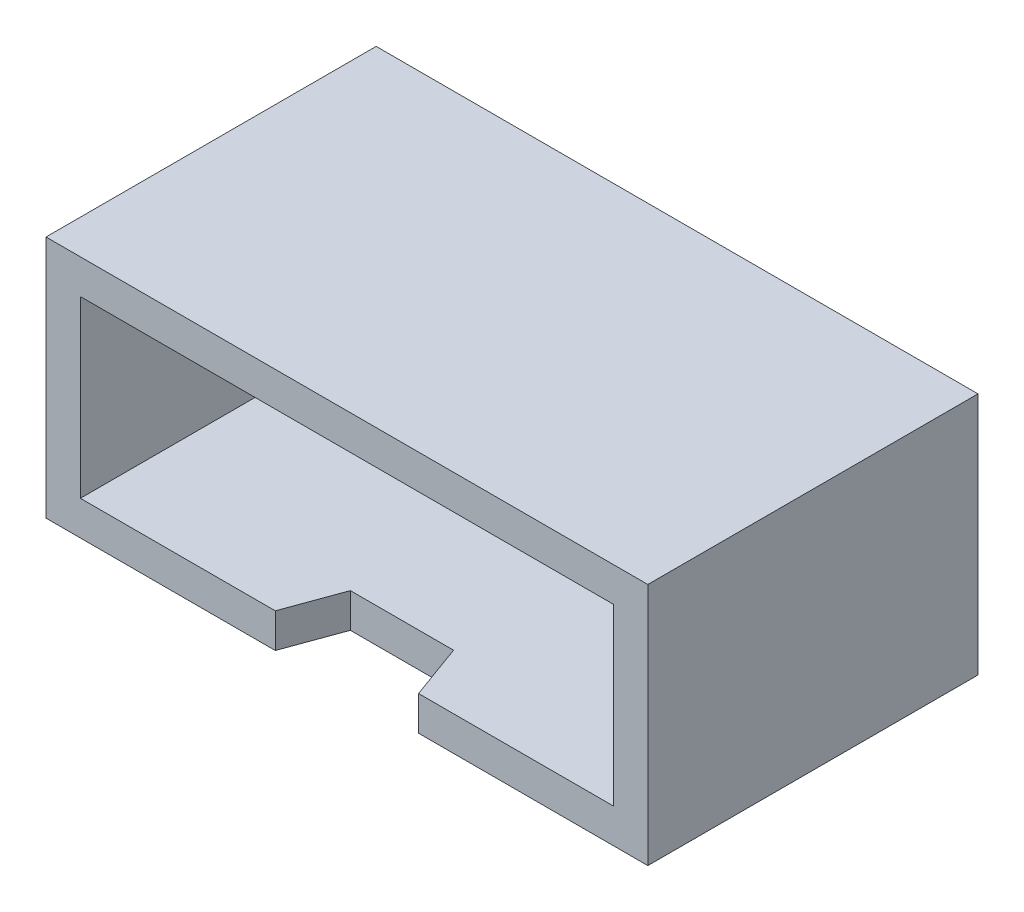
ISO-10303-21;
HEADER;
FILE_DESCRIPTION(('STEP AP214'),'2;1');
FILE_NAME('part.step','',(''),(''),'','','');
FILE_SCHEMA(('AUTOMOTIVE_DESIGN { 1 0 10303 214 1 1 1 1 }'));
ENDSEC;
DATA;
#1=APPLICATION_CONTEXT('core data for automotive mechanical design processes');
#2=APPLICATION_PROTOCOL_DEFINITION('international standard','automotive_design',2000,#1);
#3=PRODUCT_CONTEXT('',#1,'mechanical');
#4=PRODUCT('Part','Part','',(#3));
#5=PRODUCT_RELATED_PRODUCT_CATEGORY('part','',(#4));
#6=PRODUCT_DEFINITION_FORMATION('','',#4);
#7=PRODUCT_DEFINITION_CONTEXT('part definition',#1,'design');
#8=PRODUCT_DEFINITION('design','',#6,#7);
#9=PRODUCT_DEFINITION_SHAPE('','',#8);
#10=(LENGTH_UNIT() NAMED_UNIT(*) SI_UNIT(.MILLI.,.METRE.));
#11=(NAMED_UNIT(*) PLANE_ANGLE_UNIT() SI_UNIT($,.RADIAN.));
#12=(NAMED_UNIT(*) SI_UNIT($,.STERADIAN.) SOLID_ANGLE_UNIT());
#13=UNCERTAINTY_MEASURE_WITH_UNIT(LENGTH_MEASURE(1.E-05),#10,'distance_accuracy_value','');
#14=(GEOMETRIC_REPRESENTATION_CONTEXT(3) GLOBAL_UNCERTAINTY_ASSIGNED_CONTEXT((#13)) GLOBAL_UNIT_ASSIGNED_CONTEXT((#10,
#11,#12)) REPRESENTATION_CONTEXT('',''));
#15=CARTESIAN_POINT('',(0.,0.,0.));
#16=DIRECTION('',(0.,0.,1.));
#17=DIRECTION('',(1.,0.,0.));
#18=AXIS2_PLACEMENT_3D('',#15,#16,#17);
#19=CARTESIAN_POINT('',(7.98,-3.54,8.));
#20=DIRECTION('',(0.,0.,-1.));
#21=DIRECTION('',(-1.,0.,0.));
#22=AXIS2_PLACEMENT_3D('',#19,#20,#21);
#23=PLANE('',#22);
#24=DIRECTION('',(0.,1.,0.));
#25=VECTOR('',#24,1.);
#26=CARTESIAN_POINT('',(4.98,-3.54,8.));
#27=LINE('',#26,#25);
#28=CARTESIAN_POINT('',(4.98,-2.53999998509884,8.));
#29=VERTEX_POINT('',#28);
#30=CARTESIAN_POINT('',(4.98,-3.54,8.));
#31=VERTEX_POINT('',#30);
#32=EDGE_CURVE('E102',#29,#31,#27,.F.);
#33=ORIENTED_EDGE('',*,*,#32,.T.);
#34=DIRECTION('',(1.,0.,0.));
#35=VECTOR('',#34,1.);
#36=CARTESIAN_POINT('',(-2.27,-3.54,8.));
#37=LINE('',#36,#35);
#38=CARTESIAN_POINT('',(7.98,-3.54,8.));
#39=VERTEX_POINT('',#38);
#40=EDGE_CURVE('E112',#39,#31,#37,.F.);
#41=ORIENTED_EDGE('',*,*,#40,.F.);
#42=DIRECTION('',(0.,1.,0.));
#43=VECTOR('',#42,1.);
#44=CARTESIAN_POINT('',(7.98,-3.54,8.));
#45=LINE('',#44,#43);
#46=CARTESIAN_POINT('',(7.98,-2.53999998509884,8.));
#47=VERTEX_POINT('',#46);
#48=EDGE_CURVE('E20',#39,#47,#45,.T.);
#49=ORIENTED_EDGE('',*,*,#48,.T.);
#50=DIRECTION('',(1.,0.,0.));
#51=VECTOR('',#50,1.);
#52=CARTESIAN_POINT('',(14.2299999850988,-2.53999998509884,8.));
#53=LINE('',#52,#51);
#54=EDGE_CURVE('E109',#29,#47,#53,.T.);
#55=ORIENTED_EDGE('',*,*,#54,.F.);
#56=EDGE_LOOP('',(#33,#41,#49,#55));
#57=FACE_BOUND('',#56,.T.);
#58=ADVANCED_FACE('F17',(#57),#23,.F.);
#59=CARTESIAN_POINT('',(8.56235237482626,-3.54,9.6));
#60=DIRECTION('',(0.939692620785844,0.,-0.342020143325846));
#61=DIRECTION('',(-0.342020143325846,0.,-0.939692620785844));
#62=AXIS2_PLACEMENT_3D('',#59,#60,#61);
#63=PLANE('',#62);
#64=ORIENTED_EDGE('',*,*,#48,.F.);
#65=DIRECTION('',(-0.342020143325842,0.,-0.939692620785845));
#66=VECTOR('',#65,1.);
#67=CARTESIAN_POINT('',(8.56235237482626,-3.54,9.6));
#68=LINE('',#67,#66);
#69=CARTESIAN_POINT('',(8.56235237482626,-3.54,9.6));
#70=VERTEX_POINT('',#69);
#71=EDGE_CURVE('E129',#70,#39,#68,.T.);
#72=ORIENTED_EDGE('',*,*,#71,.F.);
#73=DIRECTION('',(0.,1.,0.));
#74=VECTOR('',#73,1.);
#75=CARTESIAN_POINT('',(8.56235237482626,0.,9.6));
#76=LINE('',#75,#74);
#77=CARTESIAN_POINT('',(8.56235237482626,-2.53999998509884,9.6));
#78=VERTEX_POINT('',#77);
#79=EDGE_CURVE('E119',#78,#70,#76,.F.);
#80=ORIENTED_EDGE('',*,*,#79,.F.);
#81=DIRECTION('',(0.342020143325843,0.,0.939692620785845));
#82=VECTOR('',#81,1.);
#83=CARTESIAN_POINT('',(7.98,-2.53999998509884,8.));
#84=LINE('',#83,#82);
#85=EDGE_CURVE('E116',#47,#78,#84,.T.);
#86=ORIENTED_EDGE('',*,*,#85,.F.);
#87=EDGE_LOOP('',(#64,#72,#80,#86));
#88=FACE_BOUND('',#87,.T.);
#89=ADVANCED_FACE('F117',(#88),#63,.F.);
#90=CARTESIAN_POINT('',(4.98,-3.54,8.));
#91=DIRECTION('',(-0.939692620785775,0.,-0.342020143326035));
#92=DIRECTION('',(-0.342020143326035,0.,0.939692620785775));
#93=AXIS2_PLACEMENT_3D('',#90,#91,#92);
#94=PLANE('',#93);
#95=DIRECTION('',(0.,1.,0.));
#96=VECTOR('',#95,1.);
#97=CARTESIAN_POINT('',(4.39764762517337,0.,9.6));
#98=LINE('',#97,#96);
#99=CARTESIAN_POINT('',(4.39764762517337,-3.54,9.6));
#100=VERTEX_POINT('',#99);
#101=CARTESIAN_POINT('',(4.39764762517337,-2.53999998509884,9.6));
#102=VERTEX_POINT('',#101);
#103=EDGE_CURVE('E146',#100,#102,#98,.T.);
#104=ORIENTED_EDGE('',*,*,#103,.F.);
#105=DIRECTION('',(-0.342020143326035,0.,0.939692620785775));
#106=VECTOR('',#105,1.);
#107=CARTESIAN_POINT('',(4.98,-3.54,8.));
#108=LINE('',#107,#106);
#109=EDGE_CURVE('E143',#31,#100,#108,.T.);
#110=ORIENTED_EDGE('',*,*,#109,.F.);
#111=ORIENTED_EDGE('',*,*,#32,.F.);
#112=DIRECTION('',(0.342020143326036,0.,-0.939692620785775));
#113=VECTOR('',#112,1.);
#114=CARTESIAN_POINT('',(4.39764762517337,-2.53999998509884,9.6));
#115=LINE('',#114,#113);
#116=EDGE_CURVE('E128',#102,#29,#115,.T.);
#117=ORIENTED_EDGE('',*,*,#116,.F.);
#118=EDGE_LOOP('',(#104,#110,#111,#117));
#119=FACE_BOUND('',#118,.T.);
#120=ADVANCED_FACE('F144',(#119),#94,.F.);
#121=CARTESIAN_POINT('',(-1.26999998509884,-2.53999998509884,0.));
#122=DIRECTION('',(1.,0.,0.));
#123=DIRECTION('',(0.,1.,0.));
#124=AXIS2_PLACEMENT_3D('',#121,#122,#123);
#125=PLANE('',#124);
#126=DIRECTION('',(0.,1.,0.));
#127=VECTOR('',#126,1.);
#128=CARTESIAN_POINT('',(-1.26999998509884,0.,9.6));
#129=LINE('',#128,#127);
#130=CARTESIAN_POINT('',(-1.26999998509884,-2.53999998509884,9.6));
#131=VERTEX_POINT('',#130);
#132=CARTESIAN_POINT('',(-1.26999998509884,2.53999998509884,9.6));
#133=VERTEX_POINT('',#132);
#134=EDGE_CURVE('E184',#131,#133,#129,.T.);
#135=ORIENTED_EDGE('',*,*,#134,.F.);
#136=DIRECTION('',(0.,0.,1.));
#137=VECTOR('',#136,1.);
#138=CARTESIAN_POINT('',(-1.26999998509884,-2.53999998509884,0.));
#139=LINE('',#138,#137);
#140=CARTESIAN_POINT('',(-1.26999998509884,-2.53999998509884,0.));
#141=VERTEX_POINT('',#140);
#142=EDGE_CURVE('E132',#141,#131,#139,.T.);
#143=ORIENTED_EDGE('',*,*,#142,.F.);
#144=DIRECTION('',(0.,1.,0.));
#145=VECTOR('',#144,1.);
#146=CARTESIAN_POINT('',(-1.26999998509884,0.,0.));
#147=LINE('',#146,#145);
#148=CARTESIAN_POINT('',(-1.26999998509884,2.53999998509884,0.));
#149=VERTEX_POINT('',#148);
#150=EDGE_CURVE('E162',#141,#149,#147,.T.);
#151=ORIENTED_EDGE('',*,*,#150,.T.);
#152=DIRECTION('',(0.,0.,-1.));
#153=VECTOR('',#152,1.);
#154=CARTESIAN_POINT('',(-1.26999998509884,2.53999998509884,0.));
#155=LINE('',#154,#153);
#156=EDGE_CURVE('E140',#133,#149,#155,.T.);
#157=ORIENTED_EDGE('',*,*,#156,.F.);
#158=EDGE_LOOP('',(#135,#143,#151,#157));
#159=FACE_BOUND('',#158,.T.);
#160=ADVANCED_FACE('F247',(#159),#125,.T.);
#161=CARTESIAN_POINT('',(-1.26999998509884,2.53999998509884,0.));
#162=DIRECTION('',(0.,-1.,0.));
#163=DIRECTION('',(0.,0.,-1.));
#164=AXIS2_PLACEMENT_3D('',#161,#162,#163);
#165=PLANE('',#164);
#166=DIRECTION('',(1.,0.,0.));
#167=VECTOR('',#166,1.);
#168=CARTESIAN_POINT('',(6.48,2.53999998509884,9.6));
#169=LINE('',#168,#167);
#170=CARTESIAN_POINT('',(14.2299999850988,2.53999998509884,9.6));
#171=VERTEX_POINT('',#170);
#172=EDGE_CURVE('E187',#133,#171,#169,.T.);
#173=ORIENTED_EDGE('',*,*,#172,.F.);
#174=ORIENTED_EDGE('',*,*,#156,.T.);
#175=DIRECTION('',(1.,0.,0.));
#176=VECTOR('',#175,1.);
#177=CARTESIAN_POINT('',(6.48,2.53999998509884,0.));
#178=LINE('',#177,#176);
#179=CARTESIAN_POINT('',(14.2299999850988,2.53999998509884,0.));
#180=VERTEX_POINT('',#179);
#181=EDGE_CURVE('E164',#149,#180,#178,.T.);
#182=ORIENTED_EDGE('',*,*,#181,.T.);
#183=DIRECTION('',(0.,0.,1.));
#184=VECTOR('',#183,1.);
#185=CARTESIAN_POINT('',(14.2299999850988,2.53999998509884,0.));
#186=LINE('',#185,#184);
#187=EDGE_CURVE('E124',#171,#180,#186,.F.);
#188=ORIENTED_EDGE('',*,*,#187,.F.);
#189=EDGE_LOOP('',(#173,#174,#182,#188));
#190=FACE_BOUND('',#189,.T.);
#191=ADVANCED_FACE('F243',(#190),#165,.T.);
#192=CARTESIAN_POINT('',(14.2299999850988,2.53999998509884,0.));
#193=DIRECTION('',(-1.,0.,0.));
#194=DIRECTION('',(0.,0.,1.));
#195=AXIS2_PLACEMENT_3D('',#192,#193,#194);
#196=PLANE('',#195);
#197=DIRECTION('',(0.,1.,0.));
#198=VECTOR('',#197,1.);
#199=CARTESIAN_POINT('',(14.2299999850988,0.,9.6));
#200=LINE('',#199,#198);
#201=CARTESIAN_POINT('',(14.2299999850988,-2.53999998509884,9.6));
#202=VERTEX_POINT('',#201);
#203=EDGE_CURVE('E190',#171,#202,#200,.F.);
#204=ORIENTED_EDGE('',*,*,#203,.F.);
#205=ORIENTED_EDGE('',*,*,#187,.T.);
#206=DIRECTION('',(0.,1.,0.));
#207=VECTOR('',#206,1.);
#208=CARTESIAN_POINT('',(14.2299999850988,0.,0.));
#209=LINE('',#208,#207);
#210=CARTESIAN_POINT('',(14.2299999850988,-2.53999998509884,0.));
#211=VERTEX_POINT('',#210);
#212=EDGE_CURVE('E157',#180,#211,#209,.F.);
#213=ORIENTED_EDGE('',*,*,#212,.T.);
#214=DIRECTION('',(0.,0.,1.));
#215=VECTOR('',#214,1.);
#216=CARTESIAN_POINT('',(14.2299999850988,-2.53999998509884,0.));
#217=LINE('',#216,#215);
#218=EDGE_CURVE('E123',#202,#211,#217,.F.);
#219=ORIENTED_EDGE('',*,*,#218,.F.);
#220=EDGE_LOOP('',(#204,#205,#213,#219));
#221=FACE_BOUND('',#220,.T.);
#222=ADVANCED_FACE('F240',(#221),#196,.T.);
#223=CARTESIAN_POINT('',(14.2299999850988,-2.53999998509884,0.));
#224=DIRECTION('',(0.,1.,0.));
#225=DIRECTION('',(0.,0.,1.));
#226=AXIS2_PLACEMENT_3D('',#223,#224,#225);
#227=PLANE('',#226);
#228=ORIENTED_EDGE('',*,*,#116,.T.);
#229=ORIENTED_EDGE('',*,*,#54,.T.);
#230=ORIENTED_EDGE('',*,*,#85,.T.);
#231=DIRECTION('',(1.,0.,0.));
#232=VECTOR('',#231,1.);
#233=CARTESIAN_POINT('',(6.48,-2.53999998509884,9.6));
#234=LINE('',#233,#232);
#235=EDGE_CURVE('E193',#202,#78,#234,.F.);
#236=ORIENTED_EDGE('',*,*,#235,.F.);
#237=ORIENTED_EDGE('',*,*,#218,.T.);
#238=DIRECTION('',(1.,0.,0.));
#239=VECTOR('',#238,1.);
#240=CARTESIAN_POINT('',(6.48,-2.53999998509884,0.));
#241=LINE('',#240,#239);
#242=EDGE_CURVE('E159',#211,#141,#241,.F.);
#243=ORIENTED_EDGE('',*,*,#242,.T.);
#244=ORIENTED_EDGE('',*,*,#142,.T.);
#245=DIRECTION('',(1.,0.,0.));
#246=VECTOR('',#245,1.);
#247=CARTESIAN_POINT('',(6.48,-2.53999998509884,9.6));
#248=LINE('',#247,#246);
#249=EDGE_CURVE('E181',#102,#131,#248,.F.);
#250=ORIENTED_EDGE('',*,*,#249,.F.);
#251=EDGE_LOOP('',(#228,#229,#230,#236,#237,#243,#244,#250));
#252=FACE_BOUND('',#251,.T.);
#253=ADVANCED_FACE('F126',(#252),#227,.T.);
#254=CARTESIAN_POINT('',(-2.27,-3.54,0.));
#255=DIRECTION('',(0.,-1.,0.));
#256=DIRECTION('',(0.,0.,-1.));
#257=AXIS2_PLACEMENT_3D('',#254,#255,#256);
#258=PLANE('',#257);
#259=DIRECTION('',(0.,0.,-1.));
#260=VECTOR('',#259,1.);
#261=CARTESIAN_POINT('',(15.23,-3.54,0.));
#262=LINE('',#261,#260);
#263=CARTESIAN_POINT('',(15.23,-3.54,9.6));
#264=VERTEX_POINT('',#263);
#265=CARTESIAN_POINT('',(15.23,-3.54,0.));
#266=VERTEX_POINT('',#265);
#267=EDGE_CURVE('E199',#264,#266,#262,.T.);
#268=ORIENTED_EDGE('',*,*,#267,.F.);
#269=DIRECTION('',(1.,0.,0.));
#270=VECTOR('',#269,1.);
#271=CARTESIAN_POINT('',(6.48,-3.54,9.6));
#272=LINE('',#271,#270);
#273=EDGE_CURVE('E173',#70,#264,#272,.T.);
#274=ORIENTED_EDGE('',*,*,#273,.F.);
#275=ORIENTED_EDGE('',*,*,#71,.T.);
#276=ORIENTED_EDGE('',*,*,#40,.T.);
#277=ORIENTED_EDGE('',*,*,#109,.T.);
#278=DIRECTION('',(1.,0.,0.));
#279=VECTOR('',#278,1.);
#280=CARTESIAN_POINT('',(6.48,-3.54,9.6));
#281=LINE('',#280,#279);
#282=CARTESIAN_POINT('',(-2.27,-3.54,9.6));
#283=VERTEX_POINT('',#282);
#284=EDGE_CURVE('E178',#283,#100,#281,.T.);
#285=ORIENTED_EDGE('',*,*,#284,.F.);
#286=DIRECTION('',(0.,0.,1.));
#287=VECTOR('',#286,1.);
#288=CARTESIAN_POINT('',(-2.27,-3.54,0.));
#289=LINE('',#288,#287);
#290=CARTESIAN_POINT('',(-2.27,-3.54,0.));
#291=VERTEX_POINT('',#290);
#292=EDGE_CURVE('E170',#291,#283,#289,.T.);
#293=ORIENTED_EDGE('',*,*,#292,.F.);
#294=DIRECTION('',(1.,0.,0.));
#295=VECTOR('',#294,1.);
#296=CARTESIAN_POINT('',(6.48,-3.54,0.));
#297=LINE('',#296,#295);
#298=EDGE_CURVE('E150',#291,#266,#297,.T.);
#299=ORIENTED_EDGE('',*,*,#298,.T.);
#300=EDGE_LOOP('',(#268,#274,#275,#276,#277,#285,#293,#299));
#301=FACE_BOUND('',#300,.T.);
#302=ADVANCED_FACE('F153',(#301),#258,.T.);
#303=CARTESIAN_POINT('',(6.48,0.,0.));
#304=DIRECTION('',(0.,0.,1.));
#305=DIRECTION('',(1.,0.,0.));
#306=AXIS2_PLACEMENT_3D('',#303,#304,#305);
#307=PLANE('',#306);
#308=ORIENTED_EDGE('',*,*,#150,.F.);
#309=ORIENTED_EDGE('',*,*,#242,.F.);
#310=ORIENTED_EDGE('',*,*,#212,.F.);
#311=ORIENTED_EDGE('',*,*,#181,.F.);
#312=EDGE_LOOP('',(#308,#309,#310,#311));
#313=FACE_BOUND('',#312,.T.);
#314=DIRECTION('',(0.,1.,0.));
#315=VECTOR('',#314,1.);
#316=CARTESIAN_POINT('',(-2.27,3.54,0.));
#317=LINE('',#316,#315);
#318=CARTESIAN_POINT('',(-2.27,3.54,0.));
#319=VERTEX_POINT('',#318);
#320=EDGE_CURVE('E167',#319,#291,#317,.F.);
#321=ORIENTED_EDGE('',*,*,#320,.F.);
#322=DIRECTION('',(1.,0.,0.));
#323=VECTOR('',#322,1.);
#324=CARTESIAN_POINT('',(15.23,3.54,0.));
#325=LINE('',#324,#323);
#326=CARTESIAN_POINT('',(15.23,3.54,0.));
#327=VERTEX_POINT('',#326);
#328=EDGE_CURVE('E202',#327,#319,#325,.F.);
#329=ORIENTED_EDGE('',*,*,#328,.F.);
#330=DIRECTION('',(0.,1.,0.));
#331=VECTOR('',#330,1.);
#332=CARTESIAN_POINT('',(15.23,-3.54,0.));
#333=LINE('',#332,#331);
#334=EDGE_CURVE('E195',#266,#327,#333,.T.);
#335=ORIENTED_EDGE('',*,*,#334,.F.);
#336=ORIENTED_EDGE('',*,*,#298,.F.);
#337=EDGE_LOOP('',(#321,#329,#335,#336));
#338=FACE_BOUND('',#337,.T.);
#339=ADVANCED_FACE('F218',(#313,#338),#307,.F.);
#340=CARTESIAN_POINT('',(-2.27,3.54,0.));
#341=DIRECTION('',(-1.,0.,0.));
#342=DIRECTION('',(0.,0.,1.));
#343=AXIS2_PLACEMENT_3D('',#340,#341,#342);
#344=PLANE('',#343);
#345=DIRECTION('',(0.,1.,0.));
#346=VECTOR('',#345,1.);
#347=CARTESIAN_POINT('',(-2.27,0.,9.6));
#348=LINE('',#347,#346);
#349=CARTESIAN_POINT('',(-2.27,3.54,9.6));
#350=VERTEX_POINT('',#349);
#351=EDGE_CURVE('E175',#350,#283,#348,.F.);
#352=ORIENTED_EDGE('',*,*,#351,.F.);
#353=DIRECTION('',(0.,0.,1.));
#354=VECTOR('',#353,1.);
#355=CARTESIAN_POINT('',(-2.27,3.54,0.));
#356=LINE('',#355,#354);
#357=EDGE_CURVE('E205',#319,#350,#356,.T.);
#358=ORIENTED_EDGE('',*,*,#357,.F.);
#359=ORIENTED_EDGE('',*,*,#320,.T.);
#360=ORIENTED_EDGE('',*,*,#292,.T.);
#361=EDGE_LOOP('',(#352,#358,#359,#360));
#362=FACE_BOUND('',#361,.T.);
#363=ADVANCED_FACE('F214',(#362),#344,.T.);
#364=CARTESIAN_POINT('',(6.48,0.,9.6));
#365=DIRECTION('',(0.,0.,1.));
#366=DIRECTION('',(1.,0.,0.));
#367=AXIS2_PLACEMENT_3D('',#364,#365,#366);
#368=PLANE('',#367);
#369=ORIENTED_EDGE('',*,*,#203,.T.);
#370=ORIENTED_EDGE('',*,*,#235,.T.);
#371=ORIENTED_EDGE('',*,*,#79,.T.);
#372=ORIENTED_EDGE('',*,*,#273,.T.);
#373=DIRECTION('',(0.,1.,0.));
#374=VECTOR('',#373,1.);
#375=CARTESIAN_POINT('',(15.23,-3.54,9.6));
#376=LINE('',#375,#374);
#377=CARTESIAN_POINT('',(15.23,3.54,9.6));
#378=VERTEX_POINT('',#377);
#379=EDGE_CURVE('E35',#378,#264,#376,.F.);
#380=ORIENTED_EDGE('',*,*,#379,.F.);
#381=DIRECTION('',(1.,0.,0.));
#382=VECTOR('',#381,1.);
#383=CARTESIAN_POINT('',(15.23,3.54,9.6));
#384=LINE('',#383,#382);
#385=EDGE_CURVE('E26',#350,#378,#384,.T.);
#386=ORIENTED_EDGE('',*,*,#385,.F.);
#387=ORIENTED_EDGE('',*,*,#351,.T.);
#388=ORIENTED_EDGE('',*,*,#284,.T.);
#389=ORIENTED_EDGE('',*,*,#103,.T.);
#390=ORIENTED_EDGE('',*,*,#249,.T.);
#391=ORIENTED_EDGE('',*,*,#134,.T.);
#392=ORIENTED_EDGE('',*,*,#172,.T.);
#393=EDGE_LOOP('',(#369,#370,#371,#372,#380,#386,#387,#388,#389,#390,#391,#392));
#394=FACE_BOUND('',#393,.T.);
#395=ADVANCED_FACE('F212',(#394),#368,.T.);
#396=CARTESIAN_POINT('',(15.23,-3.54,0.));
#397=DIRECTION('',(1.,0.,0.));
#398=DIRECTION('',(0.,0.,-1.));
#399=AXIS2_PLACEMENT_3D('',#396,#397,#398);
#400=PLANE('',#399);
#401=ORIENTED_EDGE('',*,*,#379,.T.);
#402=ORIENTED_EDGE('',*,*,#267,.T.);
#403=ORIENTED_EDGE('',*,*,#334,.T.);
#404=DIRECTION('',(0.,0.,1.));
#405=VECTOR('',#404,1.);
#406=CARTESIAN_POINT('',(15.23,3.54,0.));
#407=LINE('',#406,#405);
#408=EDGE_CURVE('E11',#378,#327,#407,.F.);
#409=ORIENTED_EDGE('',*,*,#408,.F.);
#410=EDGE_LOOP('',(#401,#402,#403,#409));
#411=FACE_BOUND('',#410,.T.);
#412=ADVANCED_FACE('F220',(#411),#400,.T.);
#413=CARTESIAN_POINT('',(15.23,3.54,0.));
#414=DIRECTION('',(0.,1.,0.));
#415=DIRECTION('',(0.,0.,1.));
#416=AXIS2_PLACEMENT_3D('',#413,#414,#415);
#417=PLANE('',#416);
#418=ORIENTED_EDGE('',*,*,#385,.T.);
#419=ORIENTED_EDGE('',*,*,#408,.T.);
#420=ORIENTED_EDGE('',*,*,#328,.T.);
#421=ORIENTED_EDGE('',*,*,#357,.T.);
#422=EDGE_LOOP('',(#418,#419,#420,#421));
#423=FACE_BOUND('',#422,.T.);
#424=ADVANCED_FACE('F210',(#423),#417,.T.);
#425=CLOSED_SHELL('',(#58,#89,#120,#160,#191,#222,#253,#302,#339,#363,#395,#412,#424));
#426=MANIFOLD_SOLID_BREP('B1',#425);
#427=ADVANCED_BREP_SHAPE_REPRESENTATION('',(#18,#426),#14);
#428=SHAPE_DEFINITION_REPRESENTATION(#9,#427);
ENDSEC;
END-ISO-10303-21;
